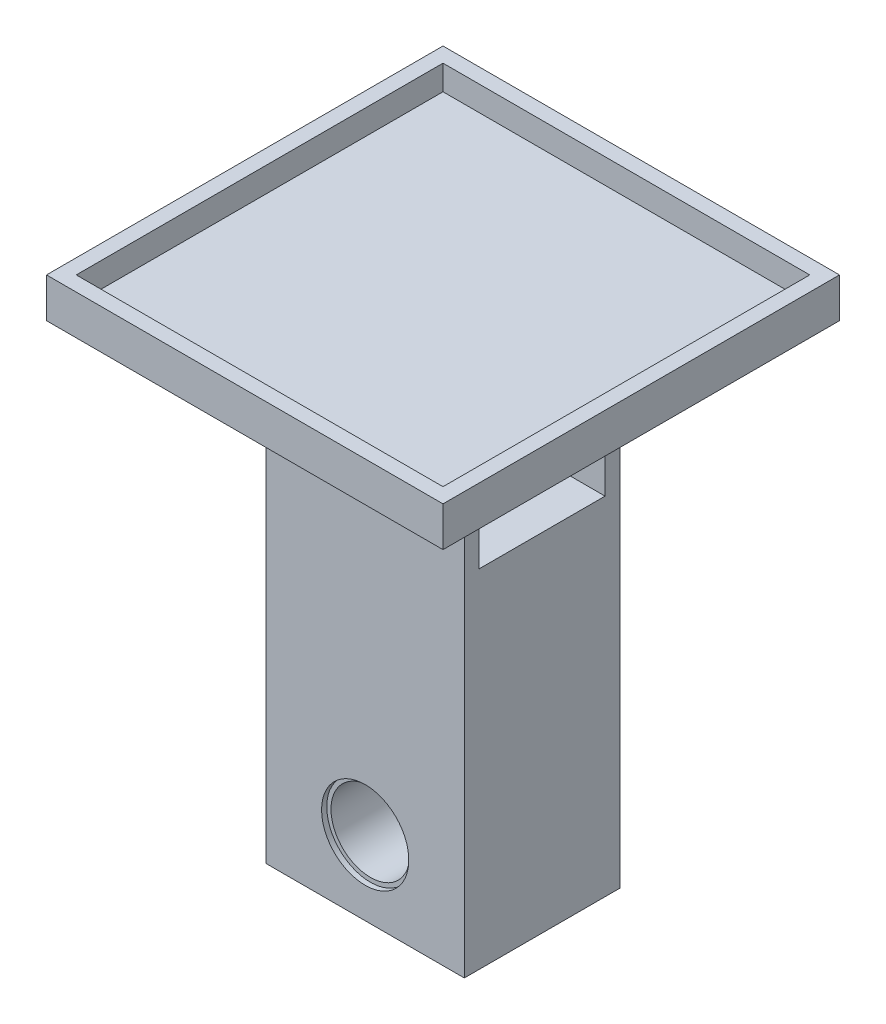
ISO-10303-21;
HEADER;
FILE_DESCRIPTION(('STEP AP214'),'2;1');
FILE_NAME('part.step','',(''),(''),'','','');
FILE_SCHEMA(('AUTOMOTIVE_DESIGN { 1 0 10303 214 1 1 1 1 }'));
ENDSEC;
DATA;
#1=APPLICATION_CONTEXT('core data for automotive mechanical design processes');
#2=APPLICATION_PROTOCOL_DEFINITION('international standard','automotive_design',2000,#1);
#3=PRODUCT_CONTEXT('',#1,'mechanical');
#4=PRODUCT('Part','Part','',(#3));
#5=PRODUCT_RELATED_PRODUCT_CATEGORY('part','',(#4));
#6=PRODUCT_DEFINITION_FORMATION('','',#4);
#7=PRODUCT_DEFINITION_CONTEXT('part definition',#1,'design');
#8=PRODUCT_DEFINITION('design','',#6,#7);
#9=PRODUCT_DEFINITION_SHAPE('','',#8);
#10=(LENGTH_UNIT() NAMED_UNIT(*) SI_UNIT(.MILLI.,.METRE.));
#11=(NAMED_UNIT(*) PLANE_ANGLE_UNIT() SI_UNIT($,.RADIAN.));
#12=(NAMED_UNIT(*) SI_UNIT($,.STERADIAN.) SOLID_ANGLE_UNIT());
#13=UNCERTAINTY_MEASURE_WITH_UNIT(LENGTH_MEASURE(1.E-05),#10,'distance_accuracy_value','');
#14=(GEOMETRIC_REPRESENTATION_CONTEXT(3) GLOBAL_UNCERTAINTY_ASSIGNED_CONTEXT((#13)) GLOBAL_UNIT_ASSIGNED_CONTEXT((#10,
#11,#12)) REPRESENTATION_CONTEXT('',''));
#15=CARTESIAN_POINT('',(0.,0.,0.));
#16=DIRECTION('',(0.,0.,1.));
#17=DIRECTION('',(1.,0.,0.));
#18=AXIS2_PLACEMENT_3D('',#15,#16,#17);
#19=CARTESIAN_POINT('',(0.,-37.5,40.));
#20=DIRECTION('',(0.,0.,-1.));
#21=DIRECTION('',(-1.,0.,0.));
#22=AXIS2_PLACEMENT_3D('',#19,#20,#21);
#23=CYLINDRICAL_SURFACE('',#22,7.95);
#24=CARTESIAN_POINT('',(0.,-37.5,-14.65));
#25=DIRECTION('',(0.,0.,-1.));
#26=DIRECTION('',(-1.,0.,0.));
#27=AXIS2_PLACEMENT_3D('',#24,#25,#26);
#28=CIRCLE('',#27,7.95);
#29=CARTESIAN_POINT('',(-7.95,-37.5,-14.65));
#30=VERTEX_POINT('',#29);
#31=EDGE_CURVE('E185',#30,#30,#28,.F.);
#32=ORIENTED_EDGE('',*,*,#31,.F.);
#33=EDGE_LOOP('',(#32));
#34=FACE_BOUND('',#33,.T.);
#35=CARTESIAN_POINT('',(0.,-37.5,14.65));
#36=DIRECTION('',(0.,0.,1.));
#37=DIRECTION('',(1.,0.,0.));
#38=AXIS2_PLACEMENT_3D('',#35,#36,#37);
#39=CIRCLE('',#38,7.95);
#40=CARTESIAN_POINT('',(7.95,-37.5,14.65));
#41=VERTEX_POINT('',#40);
#42=EDGE_CURVE('E46',#41,#41,#39,.F.);
#43=ORIENTED_EDGE('',*,*,#42,.F.);
#44=EDGE_LOOP('',(#43));
#45=FACE_BOUND('',#44,.T.);
#46=ADVANCED_FACE('F42',(#34,#45),#23,.F.);
#47=CARTESIAN_POINT('',(20.,-52.5,0.));
#48=DIRECTION('',(0.,1.,0.));
#49=DIRECTION('',(0.,0.,1.));
#50=AXIS2_PLACEMENT_3D('',#47,#48,#49);
#51=PLANE('',#50);
#52=DIRECTION('',(0.,0.,-1.));
#53=VECTOR('',#52,1.);
#54=CARTESIAN_POINT('',(-20.,-52.5,0.));
#55=LINE('',#54,#53);
#56=CARTESIAN_POINT('',(-20.,-52.5,15.7));
#57=VERTEX_POINT('',#56);
#58=CARTESIAN_POINT('',(-20.,-52.5,-15.7));
#59=VERTEX_POINT('',#58);
#60=EDGE_CURVE('E239',#57,#59,#55,.T.);
#61=ORIENTED_EDGE('',*,*,#60,.T.);
#62=DIRECTION('',(-1.,0.,0.));
#63=VECTOR('',#62,1.);
#64=CARTESIAN_POINT('',(20.,-52.5,-15.7));
#65=LINE('',#64,#63);
#66=CARTESIAN_POINT('',(20.,-52.5,-15.7));
#67=VERTEX_POINT('',#66);
#68=EDGE_CURVE('E11',#67,#59,#65,.T.);
#69=ORIENTED_EDGE('',*,*,#68,.F.);
#70=DIRECTION('',(0.,0.,-1.));
#71=VECTOR('',#70,1.);
#72=CARTESIAN_POINT('',(20.,-52.5,0.));
#73=LINE('',#72,#71);
#74=CARTESIAN_POINT('',(20.,-52.5,15.7));
#75=VERTEX_POINT('',#74);
#76=EDGE_CURVE('E240',#75,#67,#73,.T.);
#77=ORIENTED_EDGE('',*,*,#76,.F.);
#78=DIRECTION('',(-1.,0.,0.));
#79=VECTOR('',#78,1.);
#80=CARTESIAN_POINT('',(20.,-52.5,15.7));
#81=LINE('',#80,#79);
#82=EDGE_CURVE('E260',#75,#57,#81,.T.);
#83=ORIENTED_EDGE('',*,*,#82,.T.);
#84=EDGE_LOOP('',(#61,#69,#77,#83));
#85=FACE_BOUND('',#84,.T.);
#86=ADVANCED_FACE('F44',(#85),#51,.F.);
#87=CARTESIAN_POINT('',(20.,0.,-15.7));
#88=DIRECTION('',(0.,0.,1.));
#89=DIRECTION('',(0.,-1.,0.));
#90=AXIS2_PLACEMENT_3D('',#87,#88,#89);
#91=PLANE('',#90);
#92=CARTESIAN_POINT('',(0.,-37.5,-15.7));
#93=DIRECTION('',(0.,0.,-1.));
#94=DIRECTION('',(-1.,0.,0.));
#95=AXIS2_PLACEMENT_3D('',#92,#93,#94);
#96=CIRCLE('',#95,8.8);
#97=CARTESIAN_POINT('',(-8.8,-37.5,-15.7));
#98=VERTEX_POINT('',#97);
#99=EDGE_CURVE('E301',#98,#98,#96,.T.);
#100=ORIENTED_EDGE('',*,*,#99,.F.);
#101=EDGE_LOOP('',(#100));
#102=FACE_BOUND('',#101,.T.);
#103=CARTESIAN_POINT('',(0.,30.2,-15.7));
#104=DIRECTION('',(0.,0.,1.));
#105=DIRECTION('',(0.,-1.,0.));
#106=AXIS2_PLACEMENT_3D('',#103,#104,#105);
#107=CIRCLE('',#106,3.00000000000001);
#108=CARTESIAN_POINT('',(3.00000000000001,30.2,-15.7));
#109=VERTEX_POINT('',#108);
#110=EDGE_CURVE('E230',#109,#109,#107,.F.);
#111=ORIENTED_EDGE('',*,*,#110,.F.);
#112=EDGE_LOOP('',(#111));
#113=FACE_BOUND('',#112,.T.);
#114=DIRECTION('',(0.,1.,0.));
#115=VECTOR('',#114,1.);
#116=CARTESIAN_POINT('',(-20.,0.,-15.7));
#117=LINE('',#116,#115);
#118=CARTESIAN_POINT('',(-20.,44.5,-15.7));
#119=VERTEX_POINT('',#118);
#120=EDGE_CURVE('E263',#59,#119,#117,.T.);
#121=ORIENTED_EDGE('',*,*,#120,.T.);
#122=DIRECTION('',(-1.,0.,0.));
#123=VECTOR('',#122,1.);
#124=CARTESIAN_POINT('',(20.,44.5,-15.7));
#125=LINE('',#124,#123);
#126=CARTESIAN_POINT('',(20.,44.5,-15.7));
#127=VERTEX_POINT('',#126);
#128=EDGE_CURVE('E51',#127,#119,#125,.T.);
#129=ORIENTED_EDGE('',*,*,#128,.F.);
#130=DIRECTION('',(0.,1.,0.));
#131=VECTOR('',#130,1.);
#132=CARTESIAN_POINT('',(20.,0.,-15.7));
#133=LINE('',#132,#131);
#134=EDGE_CURVE('E243',#67,#127,#133,.T.);
#135=ORIENTED_EDGE('',*,*,#134,.F.);
#136=ORIENTED_EDGE('',*,*,#68,.T.);
#137=EDGE_LOOP('',(#121,#129,#135,#136));
#138=FACE_BOUND('',#137,.T.);
#139=ADVANCED_FACE('F325',(#102,#113,#138),#91,.F.);
#140=CARTESIAN_POINT('',(20.,0.,-12.7));
#141=DIRECTION('',(0.,0.,-1.));
#142=DIRECTION('',(0.,1.,0.));
#143=AXIS2_PLACEMENT_3D('',#140,#141,#142);
#144=PLANE('',#143);
#145=CARTESIAN_POINT('',(0.,30.2,-12.7));
#146=DIRECTION('',(0.,0.,-1.));
#147=DIRECTION('',(0.,1.,0.));
#148=AXIS2_PLACEMENT_3D('',#145,#146,#147);
#149=CIRCLE('',#148,3.00000000000001);
#150=CARTESIAN_POINT('',(3.00000000000001,30.2,-12.7));
#151=VERTEX_POINT('',#150);
#152=EDGE_CURVE('E236',#151,#151,#149,.T.);
#153=ORIENTED_EDGE('',*,*,#152,.T.);
#154=EDGE_LOOP('',(#153));
#155=FACE_BOUND('',#154,.T.);
#156=DIRECTION('',(0.,-1.,0.));
#157=VECTOR('',#156,1.);
#158=CARTESIAN_POINT('',(-20.,0.,-12.7));
#159=LINE('',#158,#157);
#160=CARTESIAN_POINT('',(-20.,44.5,-12.7));
#161=VERTEX_POINT('',#160);
#162=CARTESIAN_POINT('',(-20.,17.5,-12.7));
#163=VERTEX_POINT('',#162);
#164=EDGE_CURVE('E268',#161,#163,#159,.T.);
#165=ORIENTED_EDGE('',*,*,#164,.T.);
#166=DIRECTION('',(-1.,0.,0.));
#167=VECTOR('',#166,1.);
#168=CARTESIAN_POINT('',(20.,17.5,-12.7));
#169=LINE('',#168,#167);
#170=CARTESIAN_POINT('',(20.,17.5,-12.7));
#171=VERTEX_POINT('',#170);
#172=EDGE_CURVE('E290',#171,#163,#169,.T.);
#173=ORIENTED_EDGE('',*,*,#172,.F.);
#174=DIRECTION('',(0.,-1.,0.));
#175=VECTOR('',#174,1.);
#176=CARTESIAN_POINT('',(20.,0.,-12.7));
#177=LINE('',#176,#175);
#178=CARTESIAN_POINT('',(20.,44.5,-12.7));
#179=VERTEX_POINT('',#178);
#180=EDGE_CURVE('E248',#179,#171,#177,.T.);
#181=ORIENTED_EDGE('',*,*,#180,.F.);
#182=DIRECTION('',(-1.,0.,0.));
#183=VECTOR('',#182,1.);
#184=CARTESIAN_POINT('',(20.,44.5,-12.7));
#185=LINE('',#184,#183);
#186=EDGE_CURVE('E292',#179,#161,#185,.T.);
#187=ORIENTED_EDGE('',*,*,#186,.T.);
#188=EDGE_LOOP('',(#165,#173,#181,#187));
#189=FACE_BOUND('',#188,.T.);
#190=ADVANCED_FACE('F394',(#155,#189),#144,.F.);
#191=CARTESIAN_POINT('',(20.,17.5,0.));
#192=DIRECTION('',(0.,1.,0.));
#193=DIRECTION('',(0.,0.,1.));
#194=AXIS2_PLACEMENT_3D('',#191,#192,#193);
#195=PLANE('',#194);
#196=DIRECTION('',(0.,0.,-1.));
#197=VECTOR('',#196,1.);
#198=CARTESIAN_POINT('',(-20.,17.5,0.));
#199=LINE('',#198,#197);
#200=CARTESIAN_POINT('',(-20.,17.5,12.7));
#201=VERTEX_POINT('',#200);
#202=EDGE_CURVE('E271',#201,#163,#199,.T.);
#203=ORIENTED_EDGE('',*,*,#202,.F.);
#204=DIRECTION('',(-1.,0.,0.));
#205=VECTOR('',#204,1.);
#206=CARTESIAN_POINT('',(20.,17.5,12.7));
#207=LINE('',#206,#205);
#208=CARTESIAN_POINT('',(20.,17.5,12.7));
#209=VERTEX_POINT('',#208);
#210=EDGE_CURVE('E288',#209,#201,#207,.T.);
#211=ORIENTED_EDGE('',*,*,#210,.F.);
#212=DIRECTION('',(0.,0.,-1.));
#213=VECTOR('',#212,1.);
#214=CARTESIAN_POINT('',(20.,17.5,0.));
#215=LINE('',#214,#213);
#216=EDGE_CURVE('E250',#209,#171,#215,.T.);
#217=ORIENTED_EDGE('',*,*,#216,.T.);
#218=ORIENTED_EDGE('',*,*,#172,.T.);
#219=EDGE_LOOP('',(#203,#211,#217,#218));
#220=FACE_BOUND('',#219,.T.);
#221=ADVANCED_FACE('F390',(#220),#195,.T.);
#222=CARTESIAN_POINT('',(20.,0.,12.7));
#223=DIRECTION('',(0.,0.,-1.));
#224=DIRECTION('',(0.,1.,0.));
#225=AXIS2_PLACEMENT_3D('',#222,#223,#224);
#226=PLANE('',#225);
#227=CARTESIAN_POINT('',(0.,30.2,12.7));
#228=DIRECTION('',(0.,0.,-1.));
#229=DIRECTION('',(0.,1.,0.));
#230=AXIS2_PLACEMENT_3D('',#227,#228,#229);
#231=CIRCLE('',#230,3.00000000000001);
#232=CARTESIAN_POINT('',(3.00000000000001,30.2,12.7));
#233=VERTEX_POINT('',#232);
#234=EDGE_CURVE('E233',#233,#233,#231,.T.);
#235=ORIENTED_EDGE('',*,*,#234,.F.);
#236=EDGE_LOOP('',(#235));
#237=FACE_BOUND('',#236,.T.);
#238=DIRECTION('',(0.,-1.,0.));
#239=VECTOR('',#238,1.);
#240=CARTESIAN_POINT('',(-20.,0.,12.7));
#241=LINE('',#240,#239);
#242=CARTESIAN_POINT('',(-20.,44.5,12.7));
#243=VERTEX_POINT('',#242);
#244=EDGE_CURVE('E274',#243,#201,#241,.T.);
#245=ORIENTED_EDGE('',*,*,#244,.F.);
#246=DIRECTION('',(-1.,0.,0.));
#247=VECTOR('',#246,1.);
#248=CARTESIAN_POINT('',(20.,44.5,12.7));
#249=LINE('',#248,#247);
#250=CARTESIAN_POINT('',(20.,44.5,12.7));
#251=VERTEX_POINT('',#250);
#252=EDGE_CURVE('E286',#251,#243,#249,.T.);
#253=ORIENTED_EDGE('',*,*,#252,.F.);
#254=DIRECTION('',(0.,-1.,0.));
#255=VECTOR('',#254,1.);
#256=CARTESIAN_POINT('',(20.,0.,12.7));
#257=LINE('',#256,#255);
#258=EDGE_CURVE('E253',#251,#209,#257,.T.);
#259=ORIENTED_EDGE('',*,*,#258,.T.);
#260=ORIENTED_EDGE('',*,*,#210,.T.);
#261=EDGE_LOOP('',(#245,#253,#259,#260));
#262=FACE_BOUND('',#261,.T.);
#263=ADVANCED_FACE('F386',(#237,#262),#226,.T.);
#264=CARTESIAN_POINT('',(20.,0.,15.7));
#265=DIRECTION('',(0.,0.,-1.));
#266=DIRECTION('',(0.,1.,0.));
#267=AXIS2_PLACEMENT_3D('',#264,#265,#266);
#268=PLANE('',#267);
#269=CARTESIAN_POINT('',(0.,-37.5,15.7));
#270=DIRECTION('',(0.,0.,-1.));
#271=DIRECTION('',(-1.,0.,0.));
#272=AXIS2_PLACEMENT_3D('',#269,#270,#271);
#273=CIRCLE('',#272,8.8);
#274=CARTESIAN_POINT('',(-8.8,-37.5,15.7));
#275=VERTEX_POINT('',#274);
#276=EDGE_CURVE('E307',#275,#275,#273,.T.);
#277=ORIENTED_EDGE('',*,*,#276,.T.);
#278=EDGE_LOOP('',(#277));
#279=FACE_BOUND('',#278,.T.);
#280=CARTESIAN_POINT('',(0.,30.2,15.7));
#281=DIRECTION('',(0.,0.,1.));
#282=DIRECTION('',(1.,0.,0.));
#283=AXIS2_PLACEMENT_3D('',#280,#281,#282);
#284=CIRCLE('',#283,3.00000000000001);
#285=CARTESIAN_POINT('',(3.00000000000001,30.2,15.7));
#286=VERTEX_POINT('',#285);
#287=EDGE_CURVE('E227',#286,#286,#284,.T.);
#288=ORIENTED_EDGE('',*,*,#287,.F.);
#289=EDGE_LOOP('',(#288));
#290=FACE_BOUND('',#289,.T.);
#291=DIRECTION('',(0.,-1.,0.));
#292=VECTOR('',#291,1.);
#293=CARTESIAN_POINT('',(-20.,0.,15.7));
#294=LINE('',#293,#292);
#295=CARTESIAN_POINT('',(-20.,44.5,15.7));
#296=VERTEX_POINT('',#295);
#297=EDGE_CURVE('E244',#296,#57,#294,.T.);
#298=ORIENTED_EDGE('',*,*,#297,.T.);
#299=ORIENTED_EDGE('',*,*,#82,.F.);
#300=DIRECTION('',(0.,-1.,0.));
#301=VECTOR('',#300,1.);
#302=CARTESIAN_POINT('',(20.,0.,15.7));
#303=LINE('',#302,#301);
#304=CARTESIAN_POINT('',(20.,44.5,15.7));
#305=VERTEX_POINT('',#304);
#306=EDGE_CURVE('E258',#305,#75,#303,.T.);
#307=ORIENTED_EDGE('',*,*,#306,.F.);
#308=DIRECTION('',(-1.,0.,0.));
#309=VECTOR('',#308,1.);
#310=CARTESIAN_POINT('',(20.,44.5,15.7));
#311=LINE('',#310,#309);
#312=EDGE_CURVE('E283',#305,#296,#311,.T.);
#313=ORIENTED_EDGE('',*,*,#312,.T.);
#314=EDGE_LOOP('',(#298,#299,#307,#313));
#315=FACE_BOUND('',#314,.T.);
#316=ADVANCED_FACE('F379',(#279,#290,#315),#268,.F.);
#317=CARTESIAN_POINT('',(20.,0.,0.));
#318=DIRECTION('',(1.,0.,0.));
#319=DIRECTION('',(0.,0.,-1.));
#320=AXIS2_PLACEMENT_3D('',#317,#318,#319);
#321=PLANE('',#320);
#322=ORIENTED_EDGE('',*,*,#76,.T.);
#323=ORIENTED_EDGE('',*,*,#134,.T.);
#324=DIRECTION('',(0.,0.,1.));
#325=VECTOR('',#324,1.);
#326=CARTESIAN_POINT('',(20.,44.5,1.02926926241291E-13));
#327=LINE('',#326,#325);
#328=EDGE_CURVE('E246',#127,#179,#327,.T.);
#329=ORIENTED_EDGE('',*,*,#328,.T.);
#330=ORIENTED_EDGE('',*,*,#180,.T.);
#331=ORIENTED_EDGE('',*,*,#216,.F.);
#332=ORIENTED_EDGE('',*,*,#258,.F.);
#333=DIRECTION('',(0.,0.,-1.));
#334=VECTOR('',#333,1.);
#335=CARTESIAN_POINT('',(20.,44.5,0.));
#336=LINE('',#335,#334);
#337=EDGE_CURVE('E256',#305,#251,#336,.T.);
#338=ORIENTED_EDGE('',*,*,#337,.F.);
#339=ORIENTED_EDGE('',*,*,#306,.T.);
#340=EDGE_LOOP('',(#322,#323,#329,#330,#331,#332,#338,#339));
#341=FACE_BOUND('',#340,.T.);
#342=ADVANCED_FACE('F376',(#341),#321,.T.);
#343=CARTESIAN_POINT('',(-20.,0.,0.));
#344=DIRECTION('',(1.,0.,0.));
#345=DIRECTION('',(0.,0.,-1.));
#346=AXIS2_PLACEMENT_3D('',#343,#344,#345);
#347=PLANE('',#346);
#348=ORIENTED_EDGE('',*,*,#60,.F.);
#349=ORIENTED_EDGE('',*,*,#297,.F.);
#350=DIRECTION('',(0.,0.,-1.));
#351=VECTOR('',#350,1.);
#352=CARTESIAN_POINT('',(-20.,44.5,0.));
#353=LINE('',#352,#351);
#354=EDGE_CURVE('E277',#296,#243,#353,.T.);
#355=ORIENTED_EDGE('',*,*,#354,.T.);
#356=ORIENTED_EDGE('',*,*,#244,.T.);
#357=ORIENTED_EDGE('',*,*,#202,.T.);
#358=ORIENTED_EDGE('',*,*,#164,.F.);
#359=DIRECTION('',(0.,0.,1.));
#360=VECTOR('',#359,1.);
#361=CARTESIAN_POINT('',(-20.,44.5,1.02926926241291E-13));
#362=LINE('',#361,#360);
#363=EDGE_CURVE('E265',#119,#161,#362,.T.);
#364=ORIENTED_EDGE('',*,*,#363,.F.);
#365=ORIENTED_EDGE('',*,*,#120,.F.);
#366=EDGE_LOOP('',(#348,#349,#355,#356,#357,#358,#364,#365));
#367=FACE_BOUND('',#366,.T.);
#368=ADVANCED_FACE('F374',(#367),#347,.F.);
#369=CARTESIAN_POINT('',(0.,30.2,-24.1852813742386));
#370=DIRECTION('',(0.,0.,1.));
#371=DIRECTION('',(1.,0.,0.));
#372=AXIS2_PLACEMENT_3D('',#369,#370,#371);
#373=CYLINDRICAL_SURFACE('',#372,3.00000000000001);
#374=CARTESIAN_POINT('',(3.00000000000001,30.2,12.7));
#375=CARTESIAN_POINT('',(3.00000000000001,30.2,12.73125));
#376=CARTESIAN_POINT('',(3.00000000000001,30.2,12.7625));
#377=CARTESIAN_POINT('',(3.00000000000001,30.2,12.825));
#378=CARTESIAN_POINT('',(3.00000000000001,30.2,12.85625));
#379=CARTESIAN_POINT('',(3.00000000000001,30.2,12.91875));
#380=CARTESIAN_POINT('',(3.00000000000001,30.2,12.95));
#381=CARTESIAN_POINT('',(3.00000000000001,30.2,13.0125));
#382=CARTESIAN_POINT('',(3.00000000000001,30.2,13.04375));
#383=CARTESIAN_POINT('',(3.00000000000001,30.2,13.10625));
#384=CARTESIAN_POINT('',(3.00000000000001,30.2,13.1375));
#385=CARTESIAN_POINT('',(3.00000000000001,30.2,13.2));
#386=CARTESIAN_POINT('',(3.00000000000001,30.2,13.23125));
#387=CARTESIAN_POINT('',(3.00000000000001,30.2,13.29375));
#388=CARTESIAN_POINT('',(3.00000000000001,30.2,13.325));
#389=CARTESIAN_POINT('',(3.00000000000001,30.2,13.3875));
#390=CARTESIAN_POINT('',(3.00000000000001,30.2,13.41875));
#391=CARTESIAN_POINT('',(3.00000000000001,30.2,13.48125));
#392=CARTESIAN_POINT('',(3.00000000000001,30.2,13.5125));
#393=CARTESIAN_POINT('',(3.00000000000001,30.2,13.575));
#394=CARTESIAN_POINT('',(3.00000000000001,30.2,13.60625));
#395=CARTESIAN_POINT('',(3.00000000000001,30.2,13.66875));
#396=CARTESIAN_POINT('',(3.00000000000001,30.2,13.7));
#397=CARTESIAN_POINT('',(3.00000000000001,30.2,13.7625));
#398=CARTESIAN_POINT('',(3.00000000000001,30.2,13.79375));
#399=CARTESIAN_POINT('',(3.00000000000001,30.2,13.85625));
#400=CARTESIAN_POINT('',(3.00000000000001,30.2,13.8875));
#401=CARTESIAN_POINT('',(3.00000000000001,30.2,13.95));
#402=CARTESIAN_POINT('',(3.00000000000001,30.2,13.98125));
#403=CARTESIAN_POINT('',(3.00000000000001,30.2,14.04375));
#404=CARTESIAN_POINT('',(3.00000000000001,30.2,14.075));
#405=CARTESIAN_POINT('',(3.00000000000001,30.2,14.1375));
#406=CARTESIAN_POINT('',(3.00000000000001,30.2,14.16875));
#407=CARTESIAN_POINT('',(3.00000000000001,30.2,14.23125));
#408=CARTESIAN_POINT('',(3.00000000000001,30.2,14.2625));
#409=CARTESIAN_POINT('',(3.00000000000001,30.2,14.325));
#410=CARTESIAN_POINT('',(3.00000000000001,30.2,14.35625));
#411=CARTESIAN_POINT('',(3.00000000000001,30.2,14.41875));
#412=CARTESIAN_POINT('',(3.00000000000001,30.2,14.45));
#413=CARTESIAN_POINT('',(3.00000000000001,30.2,14.5125));
#414=CARTESIAN_POINT('',(3.00000000000001,30.2,14.54375));
#415=CARTESIAN_POINT('',(3.00000000000001,30.2,14.60625));
#416=CARTESIAN_POINT('',(3.00000000000001,30.2,14.6375));
#417=CARTESIAN_POINT('',(3.00000000000001,30.2,14.7));
#418=CARTESIAN_POINT('',(3.00000000000001,30.2,14.73125));
#419=CARTESIAN_POINT('',(3.00000000000001,30.2,14.79375));
#420=CARTESIAN_POINT('',(3.00000000000001,30.2,14.825));
#421=CARTESIAN_POINT('',(3.00000000000001,30.2,14.8875));
#422=CARTESIAN_POINT('',(3.00000000000001,30.2,14.91875));
#423=CARTESIAN_POINT('',(3.00000000000001,30.2,14.98125));
#424=CARTESIAN_POINT('',(3.00000000000001,30.2,15.0125));
#425=CARTESIAN_POINT('',(3.00000000000001,30.2,15.075));
#426=CARTESIAN_POINT('',(3.00000000000001,30.2,15.10625));
#427=CARTESIAN_POINT('',(3.00000000000001,30.2,15.16875));
#428=CARTESIAN_POINT('',(3.00000000000001,30.2,15.2));
#429=CARTESIAN_POINT('',(3.00000000000001,30.2,15.2625));
#430=CARTESIAN_POINT('',(3.00000000000001,30.2,15.29375));
#431=CARTESIAN_POINT('',(3.00000000000001,30.2,15.35625));
#432=CARTESIAN_POINT('',(3.00000000000001,30.2,15.3875));
#433=CARTESIAN_POINT('',(3.00000000000001,30.2,15.45));
#434=CARTESIAN_POINT('',(3.00000000000001,30.2,15.48125));
#435=CARTESIAN_POINT('',(3.00000000000001,30.2,15.54375));
#436=CARTESIAN_POINT('',(3.00000000000001,30.2,15.575));
#437=CARTESIAN_POINT('',(3.00000000000001,30.2,15.6375));
#438=CARTESIAN_POINT('',(3.00000000000001,30.2,15.66875));
#439=CARTESIAN_POINT('',(3.00000000000001,30.2,15.7));
#440=B_SPLINE_CURVE_WITH_KNOTS('',3,(#374,#375,#376,#377,#378,#379,#380,#381,#382,#383,#384,
#385,#386,#387,#388,#389,#390,#391,#392,#393,#394,#395,#396,#397,#398,#399,#400,#401,#402,#403,
#404,#405,#406,#407,#408,#409,#410,#411,#412,#413,#414,#415,#416,#417,#418,#419,#420,#421,#422,
#423,#424,#425,#426,#427,#428,#429,#430,#431,#432,#433,#434,#435,#436,#437,#438,#439),
.UNSPECIFIED.,.F.,.F.,(4,2,2,2,2,2,2,2,2,2,2,2,2,2,2,2,2,2,2,2,2,2,2,2,2,2,2,2,2,2,2,2,4),(0.,
0.0937499999999966,0.1875,0.281249999999997,0.375,0.468749999999997,0.562499999999994,
0.656249999999997,0.749999999999994,0.84374999999999,0.937499999999994,1.03124999999999,
1.12499999999999,1.21874999999999,1.31249999999999,1.40624999999999,1.49999999999999,
1.59374999999998,1.68749999999999,1.78124999999998,1.87499999999999,1.96874999999998,
2.06249999999998,2.15624999999998,2.24999999999998,2.34374999999998,2.43749999999998,
2.53124999999998,2.62499999999997,2.71874999999998,2.81249999999997,2.90624999999998,
2.99999999999998),.UNSPECIFIED.);
#441=EDGE_CURVE('BSEAM371',#233,#286,#440,.T.);
#442=ORIENTED_EDGE('',*,*,#234,.T.);
#443=ORIENTED_EDGE('',*,*,#287,.T.);
#444=ORIENTED_EDGE('',*,*,#441,.T.);
#445=ORIENTED_EDGE('',*,*,#441,.F.);
#446=EDGE_LOOP('',(#442,#444,#443,#445));
#447=FACE_BOUND('',#446,.T.);
#448=ADVANCED_FACE('F371',(#447),#373,.F.);
#449=CARTESIAN_POINT('',(3.00000000000001,30.2,-15.7));
#450=CARTESIAN_POINT('',(3.00000000000001,30.2,-15.66875));
#451=CARTESIAN_POINT('',(3.00000000000001,30.2,-15.6375));
#452=CARTESIAN_POINT('',(3.00000000000001,30.2,-15.575));
#453=CARTESIAN_POINT('',(3.00000000000001,30.2,-15.54375));
#454=CARTESIAN_POINT('',(3.00000000000001,30.2,-15.48125));
#455=CARTESIAN_POINT('',(3.00000000000001,30.2,-15.45));
#456=CARTESIAN_POINT('',(3.00000000000001,30.2,-15.3875));
#457=CARTESIAN_POINT('',(3.00000000000001,30.2,-15.35625));
#458=CARTESIAN_POINT('',(3.00000000000001,30.2,-15.29375));
#459=CARTESIAN_POINT('',(3.00000000000001,30.2,-15.2625));
#460=CARTESIAN_POINT('',(3.00000000000001,30.2,-15.2));
#461=CARTESIAN_POINT('',(3.00000000000001,30.2,-15.16875));
#462=CARTESIAN_POINT('',(3.00000000000001,30.2,-15.10625));
#463=CARTESIAN_POINT('',(3.00000000000001,30.2,-15.075));
#464=CARTESIAN_POINT('',(3.00000000000001,30.2,-15.0125));
#465=CARTESIAN_POINT('',(3.00000000000001,30.2,-14.98125));
#466=CARTESIAN_POINT('',(3.00000000000001,30.2,-14.91875));
#467=CARTESIAN_POINT('',(3.00000000000001,30.2,-14.8875));
#468=CARTESIAN_POINT('',(3.00000000000001,30.2,-14.825));
#469=CARTESIAN_POINT('',(3.00000000000001,30.2,-14.79375));
#470=CARTESIAN_POINT('',(3.00000000000001,30.2,-14.73125));
#471=CARTESIAN_POINT('',(3.00000000000001,30.2,-14.7));
#472=CARTESIAN_POINT('',(3.00000000000001,30.2,-14.6375));
#473=CARTESIAN_POINT('',(3.00000000000001,30.2,-14.60625));
#474=CARTESIAN_POINT('',(3.00000000000001,30.2,-14.54375));
#475=CARTESIAN_POINT('',(3.00000000000001,30.2,-14.5125));
#476=CARTESIAN_POINT('',(3.00000000000001,30.2,-14.45));
#477=CARTESIAN_POINT('',(3.00000000000001,30.2,-14.41875));
#478=CARTESIAN_POINT('',(3.00000000000001,30.2,-14.35625));
#479=CARTESIAN_POINT('',(3.00000000000001,30.2,-14.325));
#480=CARTESIAN_POINT('',(3.00000000000001,30.2,-14.2625));
#481=CARTESIAN_POINT('',(3.00000000000001,30.2,-14.23125));
#482=CARTESIAN_POINT('',(3.00000000000001,30.2,-14.16875));
#483=CARTESIAN_POINT('',(3.00000000000001,30.2,-14.1375));
#484=CARTESIAN_POINT('',(3.00000000000001,30.2,-14.075));
#485=CARTESIAN_POINT('',(3.00000000000001,30.2,-14.04375));
#486=CARTESIAN_POINT('',(3.00000000000001,30.2,-13.98125));
#487=CARTESIAN_POINT('',(3.00000000000001,30.2,-13.95));
#488=CARTESIAN_POINT('',(3.00000000000001,30.2,-13.8875));
#489=CARTESIAN_POINT('',(3.00000000000001,30.2,-13.85625));
#490=CARTESIAN_POINT('',(3.00000000000001,30.2,-13.79375));
#491=CARTESIAN_POINT('',(3.00000000000001,30.2,-13.7625));
#492=CARTESIAN_POINT('',(3.00000000000001,30.2,-13.7));
#493=CARTESIAN_POINT('',(3.00000000000001,30.2,-13.66875));
#494=CARTESIAN_POINT('',(3.00000000000001,30.2,-13.60625));
#495=CARTESIAN_POINT('',(3.00000000000001,30.2,-13.575));
#496=CARTESIAN_POINT('',(3.00000000000001,30.2,-13.5125));
#497=CARTESIAN_POINT('',(3.00000000000001,30.2,-13.48125));
#498=CARTESIAN_POINT('',(3.00000000000001,30.2,-13.41875));
#499=CARTESIAN_POINT('',(3.00000000000001,30.2,-13.3875));
#500=CARTESIAN_POINT('',(3.00000000000001,30.2,-13.325));
#501=CARTESIAN_POINT('',(3.00000000000001,30.2,-13.29375));
#502=CARTESIAN_POINT('',(3.00000000000001,30.2,-13.23125));
#503=CARTESIAN_POINT('',(3.00000000000001,30.2,-13.2));
#504=CARTESIAN_POINT('',(3.00000000000001,30.2,-13.1375));
#505=CARTESIAN_POINT('',(3.00000000000001,30.2,-13.10625));
#506=CARTESIAN_POINT('',(3.00000000000001,30.2,-13.04375));
#507=CARTESIAN_POINT('',(3.00000000000001,30.2,-13.0125));
#508=CARTESIAN_POINT('',(3.00000000000001,30.2,-12.95));
#509=CARTESIAN_POINT('',(3.00000000000001,30.2,-12.91875));
#510=CARTESIAN_POINT('',(3.00000000000001,30.2,-12.85625));
#511=CARTESIAN_POINT('',(3.00000000000001,30.2,-12.825));
#512=CARTESIAN_POINT('',(3.00000000000001,30.2,-12.7625));
#513=CARTESIAN_POINT('',(3.00000000000001,30.2,-12.73125));
#514=CARTESIAN_POINT('',(3.00000000000001,30.2,-12.7));
#515=B_SPLINE_CURVE_WITH_KNOTS('',3,(#449,#450,#451,#452,#453,#454,#455,#456,#457,#458,#459,
#460,#461,#462,#463,#464,#465,#466,#467,#468,#469,#470,#471,#472,#473,#474,#475,#476,#477,#478,
#479,#480,#481,#482,#483,#484,#485,#486,#487,#488,#489,#490,#491,#492,#493,#494,#495,#496,#497,
#498,#499,#500,#501,#502,#503,#504,#505,#506,#507,#508,#509,#510,#511,#512,#513,#514),
.UNSPECIFIED.,.F.,.F.,(4,2,2,2,2,2,2,2,2,2,2,2,2,2,2,2,2,2,2,2,2,2,2,2,2,2,2,2,2,2,2,2,4),(0.,
0.0937499999999983,0.187499999999998,0.281249999999999,0.374999999999999,0.468749999999999,
0.562499999999999,0.656249999999999,0.749999999999999,0.843750000000001,0.937500000000001,
1.03125,1.125,1.21875,1.3125,1.40625,1.5,1.59375,1.6875,1.78125,1.875,1.96875,2.0625,2.15625,
2.25,2.34375,2.4375,2.53125,2.625,2.71875,2.8125,2.90625,3.),.UNSPECIFIED.);
#516=EDGE_CURVE('BSEAM369',#109,#151,#515,.T.);
#517=ORIENTED_EDGE('',*,*,#110,.T.);
#518=ORIENTED_EDGE('',*,*,#152,.F.);
#519=ORIENTED_EDGE('',*,*,#516,.T.);
#520=ORIENTED_EDGE('',*,*,#516,.F.);
#521=EDGE_LOOP('',(#517,#519,#518,#520));
#522=FACE_BOUND('',#521,.T.);
#523=ADVANCED_FACE('F369',(#522),#373,.F.);
#524=CARTESIAN_POINT('',(-40.,47.5,-40.));
#525=DIRECTION('',(1.,0.,0.));
#526=DIRECTION('',(0.,0.,-1.));
#527=AXIS2_PLACEMENT_3D('',#524,#525,#526);
#528=PLANE('',#527);
#529=DIRECTION('',(0.,0.,1.));
#530=VECTOR('',#529,1.);
#531=CARTESIAN_POINT('',(-40.,44.5,-40.));
#532=LINE('',#531,#530);
#533=CARTESIAN_POINT('',(-40.,44.5,-40.));
#534=VERTEX_POINT('',#533);
#535=CARTESIAN_POINT('',(-40.,44.5,40.));
#536=VERTEX_POINT('',#535);
#537=EDGE_CURVE('E206',#534,#536,#532,.T.);
#538=ORIENTED_EDGE('',*,*,#537,.T.);
#539=DIRECTION('',(0.,-1.,0.));
#540=VECTOR('',#539,1.);
#541=CARTESIAN_POINT('',(-40.,47.5,40.));
#542=LINE('',#541,#540);
#543=CARTESIAN_POINT('',(-40.,52.5,40.));
#544=VERTEX_POINT('',#543);
#545=EDGE_CURVE('E224',#544,#536,#542,.T.);
#546=ORIENTED_EDGE('',*,*,#545,.F.);
#547=DIRECTION('',(0.,0.,1.));
#548=VECTOR('',#547,1.);
#549=CARTESIAN_POINT('',(-40.,52.5,40.));
#550=LINE('',#549,#548);
#551=CARTESIAN_POINT('',(-40.,52.5,-40.));
#552=VERTEX_POINT('',#551);
#553=EDGE_CURVE('E200',#552,#544,#550,.T.);
#554=ORIENTED_EDGE('',*,*,#553,.F.);
#555=DIRECTION('',(0.,-1.,0.));
#556=VECTOR('',#555,1.);
#557=CARTESIAN_POINT('',(-40.,47.5,-40.));
#558=LINE('',#557,#556);
#559=EDGE_CURVE('E215',#552,#534,#558,.T.);
#560=ORIENTED_EDGE('',*,*,#559,.T.);
#561=EDGE_LOOP('',(#538,#546,#554,#560));
#562=FACE_BOUND('',#561,.T.);
#563=ADVANCED_FACE('F365',(#562),#528,.F.);
#564=CARTESIAN_POINT('',(-40.,47.5,40.));
#565=DIRECTION('',(0.,0.,-1.));
#566=DIRECTION('',(-1.,0.,0.));
#567=AXIS2_PLACEMENT_3D('',#564,#565,#566);
#568=PLANE('',#567);
#569=DIRECTION('',(1.,0.,0.));
#570=VECTOR('',#569,1.);
#571=CARTESIAN_POINT('',(-40.,44.5,40.));
#572=LINE('',#571,#570);
#573=CARTESIAN_POINT('',(40.,44.5,40.));
#574=VERTEX_POINT('',#573);
#575=EDGE_CURVE('E209',#536,#574,#572,.T.);
#576=ORIENTED_EDGE('',*,*,#575,.T.);
#577=DIRECTION('',(0.,-1.,0.));
#578=VECTOR('',#577,1.);
#579=CARTESIAN_POINT('',(40.,47.5,40.));
#580=LINE('',#579,#578);
#581=CARTESIAN_POINT('',(40.,52.5,40.));
#582=VERTEX_POINT('',#581);
#583=EDGE_CURVE('E221',#582,#574,#580,.T.);
#584=ORIENTED_EDGE('',*,*,#583,.F.);
#585=DIRECTION('',(1.,0.,0.));
#586=VECTOR('',#585,1.);
#587=CARTESIAN_POINT('',(-40.,52.5,40.));
#588=LINE('',#587,#586);
#589=EDGE_CURVE('E203',#544,#582,#588,.T.);
#590=ORIENTED_EDGE('',*,*,#589,.F.);
#591=ORIENTED_EDGE('',*,*,#545,.T.);
#592=EDGE_LOOP('',(#576,#584,#590,#591));
#593=FACE_BOUND('',#592,.T.);
#594=ADVANCED_FACE('F361',(#593),#568,.F.);
#595=CARTESIAN_POINT('',(40.,47.5,-40.));
#596=DIRECTION('',(-1.,0.,0.));
#597=DIRECTION('',(0.,0.,1.));
#598=AXIS2_PLACEMENT_3D('',#595,#596,#597);
#599=PLANE('',#598);
#600=DIRECTION('',(0.,0.,-1.));
#601=VECTOR('',#600,1.);
#602=CARTESIAN_POINT('',(40.,44.5,-40.));
#603=LINE('',#602,#601);
#604=CARTESIAN_POINT('',(40.,44.5,-40.));
#605=VERTEX_POINT('',#604);
#606=EDGE_CURVE('E211',#574,#605,#603,.T.);
#607=ORIENTED_EDGE('',*,*,#606,.T.);
#608=DIRECTION('',(0.,-1.,0.));
#609=VECTOR('',#608,1.);
#610=CARTESIAN_POINT('',(40.,47.5,-40.));
#611=LINE('',#610,#609);
#612=CARTESIAN_POINT('',(40.,52.5,-40.));
#613=VERTEX_POINT('',#612);
#614=EDGE_CURVE('E218',#613,#605,#611,.T.);
#615=ORIENTED_EDGE('',*,*,#614,.F.);
#616=DIRECTION('',(0.,0.,-1.));
#617=VECTOR('',#616,1.);
#618=CARTESIAN_POINT('',(40.,52.5,40.));
#619=LINE('',#618,#617);
#620=EDGE_CURVE('E171',#582,#613,#619,.T.);
#621=ORIENTED_EDGE('',*,*,#620,.F.);
#622=ORIENTED_EDGE('',*,*,#583,.T.);
#623=EDGE_LOOP('',(#607,#615,#621,#622));
#624=FACE_BOUND('',#623,.T.);
#625=ADVANCED_FACE('F357',(#624),#599,.F.);
#626=CARTESIAN_POINT('',(-40.,47.5,-40.));
#627=DIRECTION('',(0.,0.,1.));
#628=DIRECTION('',(1.,0.,0.));
#629=AXIS2_PLACEMENT_3D('',#626,#627,#628);
#630=PLANE('',#629);
#631=DIRECTION('',(-1.,0.,0.));
#632=VECTOR('',#631,1.);
#633=CARTESIAN_POINT('',(-40.,44.5,-40.));
#634=LINE('',#633,#632);
#635=EDGE_CURVE('E213',#605,#534,#634,.T.);
#636=ORIENTED_EDGE('',*,*,#635,.T.);
#637=ORIENTED_EDGE('',*,*,#559,.F.);
#638=DIRECTION('',(-1.,0.,0.));
#639=VECTOR('',#638,1.);
#640=CARTESIAN_POINT('',(-40.,52.5,-40.));
#641=LINE('',#640,#639);
#642=EDGE_CURVE('E197',#613,#552,#641,.T.);
#643=ORIENTED_EDGE('',*,*,#642,.F.);
#644=ORIENTED_EDGE('',*,*,#614,.T.);
#645=EDGE_LOOP('',(#636,#637,#643,#644));
#646=FACE_BOUND('',#645,.T.);
#647=ADVANCED_FACE('F353',(#646),#630,.F.);
#648=CARTESIAN_POINT('',(0.,44.5,0.));
#649=DIRECTION('',(0.,1.,0.));
#650=DIRECTION('',(0.,0.,1.));
#651=AXIS2_PLACEMENT_3D('',#648,#649,#650);
#652=PLANE('',#651);
#653=ORIENTED_EDGE('',*,*,#328,.F.);
#654=ORIENTED_EDGE('',*,*,#128,.T.);
#655=ORIENTED_EDGE('',*,*,#363,.T.);
#656=ORIENTED_EDGE('',*,*,#186,.F.);
#657=EDGE_LOOP('',(#653,#654,#655,#656));
#658=FACE_BOUND('',#657,.T.);
#659=ORIENTED_EDGE('',*,*,#337,.T.);
#660=ORIENTED_EDGE('',*,*,#252,.T.);
#661=ORIENTED_EDGE('',*,*,#354,.F.);
#662=ORIENTED_EDGE('',*,*,#312,.F.);
#663=EDGE_LOOP('',(#659,#660,#661,#662));
#664=FACE_BOUND('',#663,.T.);
#665=ORIENTED_EDGE('',*,*,#537,.F.);
#666=ORIENTED_EDGE('',*,*,#635,.F.);
#667=ORIENTED_EDGE('',*,*,#606,.F.);
#668=ORIENTED_EDGE('',*,*,#575,.F.);
#669=EDGE_LOOP('',(#665,#666,#667,#668));
#670=FACE_BOUND('',#669,.T.);
#671=ADVANCED_FACE('F346',(#658,#664,#670),#652,.F.);
#672=CARTESIAN_POINT('',(0.,52.5,0.));
#673=DIRECTION('',(0.,-1.,0.));
#674=DIRECTION('',(0.,0.,-1.));
#675=AXIS2_PLACEMENT_3D('',#672,#673,#674);
#676=PLANE('',#675);
#677=ORIENTED_EDGE('',*,*,#620,.T.);
#678=ORIENTED_EDGE('',*,*,#642,.T.);
#679=ORIENTED_EDGE('',*,*,#553,.T.);
#680=ORIENTED_EDGE('',*,*,#589,.T.);
#681=EDGE_LOOP('',(#677,#678,#679,#680));
#682=FACE_BOUND('',#681,.T.);
#683=DIRECTION('',(0.,0.,1.));
#684=VECTOR('',#683,1.);
#685=CARTESIAN_POINT('',(-37.,52.5,37.));
#686=LINE('',#685,#684);
#687=CARTESIAN_POINT('',(-37.,52.5,-37.));
#688=VERTEX_POINT('',#687);
#689=CARTESIAN_POINT('',(-37.,52.5,37.));
#690=VERTEX_POINT('',#689);
#691=EDGE_CURVE('E156',#688,#690,#686,.T.);
#692=ORIENTED_EDGE('',*,*,#691,.F.);
#693=DIRECTION('',(-1.,0.,0.));
#694=VECTOR('',#693,1.);
#695=CARTESIAN_POINT('',(-37.,52.5,-37.));
#696=LINE('',#695,#694);
#697=CARTESIAN_POINT('',(37.,52.5,-37.));
#698=VERTEX_POINT('',#697);
#699=EDGE_CURVE('E179',#698,#688,#696,.T.);
#700=ORIENTED_EDGE('',*,*,#699,.F.);
#701=DIRECTION('',(0.,0.,-1.));
#702=VECTOR('',#701,1.);
#703=CARTESIAN_POINT('',(37.,52.5,37.));
#704=LINE('',#703,#702);
#705=CARTESIAN_POINT('',(37.,52.5,37.));
#706=VERTEX_POINT('',#705);
#707=EDGE_CURVE('E177',#706,#698,#704,.T.);
#708=ORIENTED_EDGE('',*,*,#707,.F.);
#709=DIRECTION('',(1.,0.,0.));
#710=VECTOR('',#709,1.);
#711=CARTESIAN_POINT('',(-37.,52.5,37.));
#712=LINE('',#711,#710);
#713=EDGE_CURVE('E165',#690,#706,#712,.T.);
#714=ORIENTED_EDGE('',*,*,#713,.F.);
#715=EDGE_LOOP('',(#692,#700,#708,#714));
#716=FACE_BOUND('',#715,.T.);
#717=ADVANCED_FACE('F175',(#682,#716),#676,.F.);
#718=CARTESIAN_POINT('',(-37.,52.5,37.));
#719=DIRECTION('',(1.,0.,0.));
#720=DIRECTION('',(0.,0.,-1.));
#721=AXIS2_PLACEMENT_3D('',#718,#719,#720);
#722=PLANE('',#721);
#723=DIRECTION('',(0.,0.,1.));
#724=VECTOR('',#723,1.);
#725=CARTESIAN_POINT('',(-37.,47.5,37.));
#726=LINE('',#725,#724);
#727=CARTESIAN_POINT('',(-37.,47.5,-37.));
#728=VERTEX_POINT('',#727);
#729=CARTESIAN_POINT('',(-37.,47.5,37.));
#730=VERTEX_POINT('',#729);
#731=EDGE_CURVE('E59',#728,#730,#726,.T.);
#732=ORIENTED_EDGE('',*,*,#731,.F.);
#733=DIRECTION('',(0.,-1.,0.));
#734=VECTOR('',#733,1.);
#735=CARTESIAN_POINT('',(-37.,52.5,-37.));
#736=LINE('',#735,#734);
#737=EDGE_CURVE('E161',#688,#728,#736,.T.);
#738=ORIENTED_EDGE('',*,*,#737,.F.);
#739=ORIENTED_EDGE('',*,*,#691,.T.);
#740=DIRECTION('',(0.,-1.,0.));
#741=VECTOR('',#740,1.);
#742=CARTESIAN_POINT('',(-37.,52.5,37.));
#743=LINE('',#742,#741);
#744=EDGE_CURVE('E159',#690,#730,#743,.T.);
#745=ORIENTED_EDGE('',*,*,#744,.T.);
#746=EDGE_LOOP('',(#732,#738,#739,#745));
#747=FACE_BOUND('',#746,.T.);
#748=ADVANCED_FACE('F158',(#747),#722,.T.);
#749=CARTESIAN_POINT('',(-37.,52.5,37.));
#750=DIRECTION('',(0.,0.,-1.));
#751=DIRECTION('',(-1.,0.,0.));
#752=AXIS2_PLACEMENT_3D('',#749,#750,#751);
#753=PLANE('',#752);
#754=DIRECTION('',(1.,0.,0.));
#755=VECTOR('',#754,1.);
#756=CARTESIAN_POINT('',(-37.,47.5,37.));
#757=LINE('',#756,#755);
#758=CARTESIAN_POINT('',(37.,47.5,37.));
#759=VERTEX_POINT('',#758);
#760=EDGE_CURVE('E63',#730,#759,#757,.T.);
#761=ORIENTED_EDGE('',*,*,#760,.F.);
#762=ORIENTED_EDGE('',*,*,#744,.F.);
#763=ORIENTED_EDGE('',*,*,#713,.T.);
#764=DIRECTION('',(0.,-1.,0.));
#765=VECTOR('',#764,1.);
#766=CARTESIAN_POINT('',(37.,52.5,37.));
#767=LINE('',#766,#765);
#768=EDGE_CURVE('E172',#706,#759,#767,.T.);
#769=ORIENTED_EDGE('',*,*,#768,.T.);
#770=EDGE_LOOP('',(#761,#762,#763,#769));
#771=FACE_BOUND('',#770,.T.);
#772=ADVANCED_FACE('F169',(#771),#753,.T.);
#773=CARTESIAN_POINT('',(37.,52.5,37.));
#774=DIRECTION('',(-1.,0.,0.));
#775=DIRECTION('',(0.,0.,1.));
#776=AXIS2_PLACEMENT_3D('',#773,#774,#775);
#777=PLANE('',#776);
#778=DIRECTION('',(0.,0.,-1.));
#779=VECTOR('',#778,1.);
#780=CARTESIAN_POINT('',(37.,47.5,37.));
#781=LINE('',#780,#779);
#782=CARTESIAN_POINT('',(37.,47.5,-37.));
#783=VERTEX_POINT('',#782);
#784=EDGE_CURVE('E187',#759,#783,#781,.T.);
#785=ORIENTED_EDGE('',*,*,#784,.F.);
#786=ORIENTED_EDGE('',*,*,#768,.F.);
#787=ORIENTED_EDGE('',*,*,#707,.T.);
#788=DIRECTION('',(0.,-1.,0.));
#789=VECTOR('',#788,1.);
#790=CARTESIAN_POINT('',(37.,52.5,-37.));
#791=LINE('',#790,#789);
#792=EDGE_CURVE('E191',#698,#783,#791,.T.);
#793=ORIENTED_EDGE('',*,*,#792,.T.);
#794=EDGE_LOOP('',(#785,#786,#787,#793));
#795=FACE_BOUND('',#794,.T.);
#796=ADVANCED_FACE('F335',(#795),#777,.T.);
#797=CARTESIAN_POINT('',(-37.,52.5,-37.));
#798=DIRECTION('',(0.,0.,1.));
#799=DIRECTION('',(1.,0.,0.));
#800=AXIS2_PLACEMENT_3D('',#797,#798,#799);
#801=PLANE('',#800);
#802=DIRECTION('',(-1.,0.,0.));
#803=VECTOR('',#802,1.);
#804=CARTESIAN_POINT('',(-37.,47.5,-37.));
#805=LINE('',#804,#803);
#806=EDGE_CURVE('E166',#783,#728,#805,.T.);
#807=ORIENTED_EDGE('',*,*,#806,.F.);
#808=ORIENTED_EDGE('',*,*,#792,.F.);
#809=ORIENTED_EDGE('',*,*,#699,.T.);
#810=ORIENTED_EDGE('',*,*,#737,.T.);
#811=EDGE_LOOP('',(#807,#808,#809,#810));
#812=FACE_BOUND('',#811,.T.);
#813=ADVANCED_FACE('F331',(#812),#801,.T.);
#814=CARTESIAN_POINT('',(0.,47.5,0.));
#815=DIRECTION('',(0.,1.,0.));
#816=DIRECTION('',(0.,0.,1.));
#817=AXIS2_PLACEMENT_3D('',#814,#815,#816);
#818=PLANE('',#817);
#819=ORIENTED_EDGE('',*,*,#731,.T.);
#820=ORIENTED_EDGE('',*,*,#760,.T.);
#821=ORIENTED_EDGE('',*,*,#784,.T.);
#822=ORIENTED_EDGE('',*,*,#806,.T.);
#823=EDGE_LOOP('',(#819,#820,#821,#822));
#824=FACE_BOUND('',#823,.T.);
#825=ADVANCED_FACE('F334',(#824),#818,.T.);
#826=CARTESIAN_POINT('',(0.,-37.5,-14.65));
#827=DIRECTION('',(0.,0.,-1.));
#828=DIRECTION('',(-1.,0.,0.));
#829=AXIS2_PLACEMENT_3D('',#826,#827,#828);
#830=PLANE('',#829);
#831=CARTESIAN_POINT('',(0.,-37.5,-14.65));
#832=DIRECTION('',(0.,0.,-1.));
#833=DIRECTION('',(-1.,0.,0.));
#834=AXIS2_PLACEMENT_3D('',#831,#832,#833);
#835=CIRCLE('',#834,8.8);
#836=CARTESIAN_POINT('',(-8.8,-37.5,-14.65));
#837=VERTEX_POINT('',#836);
#838=EDGE_CURVE('E297',#837,#837,#835,.T.);
#839=ORIENTED_EDGE('',*,*,#838,.T.);
#840=EDGE_LOOP('',(#839));
#841=FACE_BOUND('',#840,.T.);
#842=ORIENTED_EDGE('',*,*,#31,.T.);
#843=EDGE_LOOP('',(#842));
#844=FACE_BOUND('',#843,.T.);
#845=ADVANCED_FACE('F350',(#841,#844),#830,.T.);
#846=CARTESIAN_POINT('',(0.,-37.5,-14.65));
#847=DIRECTION('',(0.,0.,-1.));
#848=DIRECTION('',(-1.,0.,0.));
#849=AXIS2_PLACEMENT_3D('',#846,#847,#848);
#850=CYLINDRICAL_SURFACE('',#849,8.8);
#851=ORIENTED_EDGE('',*,*,#838,.F.);
#852=EDGE_LOOP('',(#851));
#853=FACE_BOUND('',#852,.T.);
#854=ORIENTED_EDGE('',*,*,#99,.T.);
#855=EDGE_LOOP('',(#854));
#856=FACE_BOUND('',#855,.T.);
#857=ADVANCED_FACE('F329',(#853,#856),#850,.F.);
#858=CARTESIAN_POINT('',(0.,-37.5,14.65));
#859=DIRECTION('',(0.,0.,1.));
#860=DIRECTION('',(-1.,0.,0.));
#861=AXIS2_PLACEMENT_3D('',#858,#859,#860);
#862=PLANE('',#861);
#863=CARTESIAN_POINT('',(0.,-37.5,14.65));
#864=DIRECTION('',(0.,0.,-1.));
#865=DIRECTION('',(-1.,0.,0.));
#866=AXIS2_PLACEMENT_3D('',#863,#864,#865);
#867=CIRCLE('',#866,8.8);
#868=CARTESIAN_POINT('',(-8.8,-37.5,14.65));
#869=VERTEX_POINT('',#868);
#870=EDGE_CURVE('E310',#869,#869,#867,.T.);
#871=ORIENTED_EDGE('',*,*,#870,.F.);
#872=EDGE_LOOP('',(#871));
#873=FACE_BOUND('',#872,.T.);
#874=ORIENTED_EDGE('',*,*,#42,.T.);
#875=EDGE_LOOP('',(#874));
#876=FACE_BOUND('',#875,.T.);
#877=ADVANCED_FACE('F317',(#873,#876),#862,.T.);
#878=CARTESIAN_POINT('',(0.,-37.5,14.65));
#879=DIRECTION('',(0.,0.,1.));
#880=DIRECTION('',(1.,0.,0.));
#881=AXIS2_PLACEMENT_3D('',#878,#879,#880);
#882=CYLINDRICAL_SURFACE('',#881,8.8);
#883=ORIENTED_EDGE('',*,*,#870,.T.);
#884=EDGE_LOOP('',(#883));
#885=FACE_BOUND('',#884,.T.);
#886=ORIENTED_EDGE('',*,*,#276,.F.);
#887=EDGE_LOOP('',(#886));
#888=FACE_BOUND('',#887,.T.);
#889=ADVANCED_FACE('F507',(#885,#888),#882,.F.);
#890=CLOSED_SHELL('',(#46,#86,#139,#190,#221,#263,#316,#342,#368,#448,#523,#563,#594,#625,#647,
#671,#717,#748,#772,#796,#813,#825,#845,#857,#877,#889));
#891=MANIFOLD_SOLID_BREP('B2',#890);
#892=ADVANCED_BREP_SHAPE_REPRESENTATION('',(#18,#891),#14);
#893=SHAPE_DEFINITION_REPRESENTATION(#9,#892);
ENDSEC;
END-ISO-10303-21;
